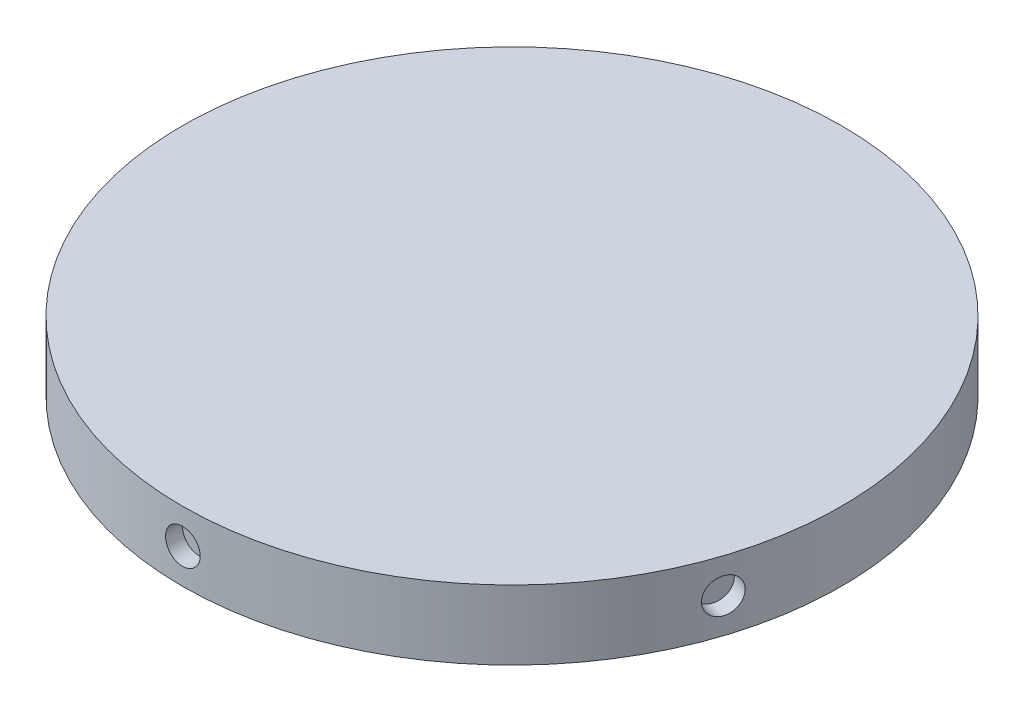
ISO-10303-21;
HEADER;
FILE_DESCRIPTION(('STEP AP214'),'2;1');
FILE_NAME('part.step','',(''),(''),'','','');
FILE_SCHEMA(('AUTOMOTIVE_DESIGN { 1 0 10303 214 1 1 1 1 }'));
ENDSEC;
DATA;
#1=APPLICATION_CONTEXT('core data for automotive mechanical design processes');
#2=APPLICATION_PROTOCOL_DEFINITION('international standard','automotive_design',2000,#1);
#3=PRODUCT_CONTEXT('',#1,'mechanical');
#4=PRODUCT('Part','Part','',(#3));
#5=PRODUCT_RELATED_PRODUCT_CATEGORY('part','',(#4));
#6=PRODUCT_DEFINITION_FORMATION('','',#4);
#7=PRODUCT_DEFINITION_CONTEXT('part definition',#1,'design');
#8=PRODUCT_DEFINITION('design','',#6,#7);
#9=PRODUCT_DEFINITION_SHAPE('','',#8);
#10=(LENGTH_UNIT() NAMED_UNIT(*) SI_UNIT(.MILLI.,.METRE.));
#11=(NAMED_UNIT(*) PLANE_ANGLE_UNIT() SI_UNIT($,.RADIAN.));
#12=(NAMED_UNIT(*) SI_UNIT($,.STERADIAN.) SOLID_ANGLE_UNIT());
#13=UNCERTAINTY_MEASURE_WITH_UNIT(LENGTH_MEASURE(1.E-05),#10,'distance_accuracy_value','');
#14=(GEOMETRIC_REPRESENTATION_CONTEXT(3) GLOBAL_UNCERTAINTY_ASSIGNED_CONTEXT((#13)) GLOBAL_UNIT_ASSIGNED_CONTEXT((#10,
#11,#12)) REPRESENTATION_CONTEXT('',''));
#15=CARTESIAN_POINT('',(0.,0.,0.));
#16=DIRECTION('',(0.,0.,1.));
#17=DIRECTION('',(1.,0.,0.));
#18=AXIS2_PLACEMENT_3D('',#15,#16,#17);
#19=CARTESIAN_POINT('',(0.,12.7,0.));
#20=DIRECTION('',(0.,-1.,0.));
#21=DIRECTION('',(0.,0.,-1.));
#22=AXIS2_PLACEMENT_3D('',#19,#20,#21);
#23=CYLINDRICAL_SURFACE('',#22,60.325);
#24=CARTESIAN_POINT('',(58.2740949216092,6.35,15.5960086582203));
#25=CARTESIAN_POINT('',(58.2740935598911,6.17179141950539,15.5960164809418));
#26=CARTESIAN_POINT('',(58.2702030382742,5.99345676522359,15.6105731562402));
#27=CARTESIAN_POINT('',(58.2546757506922,5.64170798205644,15.6684153734285));
#28=CARTESIAN_POINT('',(58.24302987893,5.46829988744188,15.7117346862469));
#29=CARTESIAN_POINT('',(58.2121399914263,5.13155050283682,15.8257970891836));
#30=CARTESIAN_POINT('',(58.1928998753155,4.96820409587701,15.8965261041311));
#31=CARTESIAN_POINT('',(58.14708864284,4.65616319450134,16.0632857166009));
#32=CARTESIAN_POINT('',(58.1205192469114,4.50746527268123,16.1593103761207));
#33=CARTESIAN_POINT('',(58.0604181120316,4.22873381288969,16.373938682914));
#34=CARTESIAN_POINT('',(58.0268796425148,4.09871852501773,16.4925641482345));
#35=CARTESIAN_POINT('',(57.9534219336702,3.86119872222298,16.7488579983049));
#36=CARTESIAN_POINT('',(57.913502432921,3.75369512998755,16.8865271632154));
#37=CARTESIAN_POINT('',(57.8280214802842,3.56419888880969,17.1769744509301));
#38=CARTESIAN_POINT('',(57.7824568650492,3.48222063468934,17.3297610353238));
#39=CARTESIAN_POINT('',(57.6866844028689,3.34619446923017,17.6459436016992));
#40=CARTESIAN_POINT('',(57.6364765938608,3.29214632971243,17.8093394969944));
#41=CARTESIAN_POINT('',(57.5326733506348,3.2135633237823,18.1418691213455));
#42=CARTESIAN_POINT('',(57.4790811299775,3.18900089080169,18.3109973387969));
#43=CARTESIAN_POINT('',(57.369887151209,3.17000145053513,18.650293016753));
#44=CARTESIAN_POINT('',(57.3142854102299,3.17556418647784,18.8204604683875));
#45=CARTESIAN_POINT('',(57.2027331990982,3.21663433069223,19.1568347070523));
#46=CARTESIAN_POINT('',(57.1467831289393,3.2521120715319,19.3230452503863));
#47=CARTESIAN_POINT('',(57.0362139592471,3.35195914400422,19.6470160269992));
#48=CARTESIAN_POINT('',(56.981594865738,3.41632860637849,19.8047762220349));
#49=CARTESIAN_POINT('',(56.8754620752649,3.57216569110866,20.1075412347327));
#50=CARTESIAN_POINT('',(56.8239499411786,3.6636468167213,20.2525396494674));
#51=CARTESIAN_POINT('',(56.725850613371,3.87110056087535,20.525705703149));
#52=CARTESIAN_POINT('',(56.6792634584003,3.98707337210033,20.6538732096691));
#53=CARTESIAN_POINT('',(56.5926531749035,4.24038613108785,20.8900240838425));
#54=CARTESIAN_POINT('',(56.5526380750506,4.37775182011244,20.997982785809));
#55=CARTESIAN_POINT('',(56.4807516772796,4.66986064481821,21.1905855844194));
#56=CARTESIAN_POINT('',(56.4488803817064,4.82460378550307,21.2752296743501));
#57=CARTESIAN_POINT('',(56.3945208463469,5.14709074014603,21.4189069170698));
#58=CARTESIAN_POINT('',(56.3720329500819,5.31483502980283,21.4779391322247));
#59=CARTESIAN_POINT('',(56.3373377006269,5.65855547387976,21.568782782084));
#60=CARTESIAN_POINT('',(56.3251302617611,5.83453155968436,21.6005944436407));
#61=CARTESIAN_POINT('',(56.3114972086904,6.18949426167802,21.6361104731803));
#62=CARTESIAN_POINT('',(56.3100586788124,6.36847701340148,21.6398485112342));
#63=CARTESIAN_POINT('',(56.3179876587267,6.72457105995048,21.6192046249637));
#64=CARTESIAN_POINT('',(56.3273551288546,6.90168236164295,21.5948228038558));
#65=CARTESIAN_POINT('',(56.3565091034409,7.24890467748867,21.5186233782586));
#66=CARTESIAN_POINT('',(56.3762897418088,7.41901957484243,21.4668212204836));
#67=CARTESIAN_POINT('',(56.4254778191091,7.74753981216546,21.3371941889757));
#68=CARTESIAN_POINT('',(56.4548853198443,7.90594507695288,21.2593691481803));
#69=CARTESIAN_POINT('',(56.5222109664278,8.20671513945481,21.0797169858428));
#70=CARTESIAN_POINT('',(56.5601371942799,8.34906451047537,20.9778670664528));
#71=CARTESIAN_POINT('',(56.6430420374702,8.61352678773028,20.7529693959175));
#72=CARTESIAN_POINT('',(56.6880207024882,8.7356395513992,20.6299214954464));
#73=CARTESIAN_POINT('',(56.7834254998003,8.95628342092408,20.3658514172115));
#74=CARTESIAN_POINT('',(56.8338569371126,9.0547912563733,20.2248117107432));
#75=CARTESIAN_POINT('',(56.9383509263756,9.22526988181571,19.9287338098999));
#76=CARTESIAN_POINT('',(56.9924134612471,9.29724079661842,19.7736956813672));
#77=CARTESIAN_POINT('',(57.1023254200859,9.41256194066804,19.4540121236109));
#78=CARTESIAN_POINT('',(57.1581739007086,9.45592702614538,19.2893717296884));
#79=CARTESIAN_POINT('',(57.2699173825609,9.51285418106591,18.9550321128248));
#80=CARTESIAN_POINT('',(57.3258123834882,9.52641644266634,18.7853329225081));
#81=CARTESIAN_POINT('',(57.4359332791788,9.52335114348945,18.4458936554643));
#82=CARTESIAN_POINT('',(57.4901611104538,9.50676006755393,18.2761538762923));
#83=CARTESIAN_POINT('',(57.5955490366075,9.44393451840173,17.941270382592));
#84=CARTESIAN_POINT('',(57.6467091257723,9.39769998997449,17.7761266766244));
#85=CARTESIAN_POINT('',(57.744701576661,9.27690760496991,17.4551780977181));
#86=CARTESIAN_POINT('',(57.7915339166524,9.20234960617182,17.2993732716773));
#87=CARTESIAN_POINT('',(57.8798336306308,9.02703271053505,17.0016067399213));
#88=CARTESIAN_POINT('',(57.9213011643306,8.9262745939548,16.8596446221333));
#89=CARTESIAN_POINT('',(57.9980994385415,8.70128586798166,16.5935325659201));
#90=CARTESIAN_POINT('',(58.033423383112,8.5770295783384,16.469402378967));
#91=CARTESIAN_POINT('',(58.0972693953285,8.30859324730592,16.2427466611513));
#92=CARTESIAN_POINT('',(58.1257897890591,8.16440831651488,16.1402264478322));
#93=CARTESIAN_POINT('',(58.1755987926046,7.86008435553708,15.9597659827837));
#94=CARTESIAN_POINT('',(58.1968800451471,7.69992930706033,15.8818507432689));
#95=CARTESIAN_POINT('',(58.2318545714961,7.3684458854963,15.753133937127));
#96=CARTESIAN_POINT('',(58.2455567942764,7.1971309579249,15.702300396286));
#97=CARTESIAN_POINT('',(58.2616176417241,6.91229560230922,15.6425723177308));
#98=CARTESIAN_POINT('',(58.266293459383,6.80061941629706,15.6251342117068));
#99=CARTESIAN_POINT('',(58.2725325296186,6.57597905390293,15.6018499070206));
#100=CARTESIAN_POINT('',(58.2740957851726,6.46301487875312,15.5960036972699));
#101=CARTESIAN_POINT('',(58.2740949216092,6.35,15.5960086582203));
#102=B_SPLINE_CURVE_WITH_KNOTS('',3,(#24,#25,#26,#27,#28,#29,#30,#31,#32,#33,#34,#35,#36,#37,
#38,#39,#40,#41,#42,#43,#44,#45,#46,#47,#48,#49,#50,#51,#52,#53,#54,#55,#56,#57,#58,#59,#60,#61,
#62,#63,#64,#65,#66,#67,#68,#69,#70,#71,#72,#73,#74,#75,#76,#77,#78,#79,#80,#81,#82,#83,#84,#85,
#86,#87,#88,#89,#90,#91,#92,#93,#94,#95,#96,#97,#98,#99,#100,#101),.UNSPECIFIED.,.T.,.F.,(4,2,2,
2,2,2,2,2,2,2,2,2,2,2,2,2,2,2,2,2,2,2,2,2,2,2,2,2,2,2,2,2,2,2,2,2,2,2,4),(0.,0.53421318853449,
1.06905472186082,1.60362197157737,2.13806384645123,2.67302429172578,3.20800665914605,
3.74329018168468,4.27856933108164,4.81334765036072,5.34812141147339,5.88236544746068,
6.41661190104814,6.9511248903171,7.48564208491947,8.02080748573454,8.55597304064593,
9.09115818596848,9.62633887108908,10.1608775851562,10.6954143371549,11.2296502882136,
11.7638896690429,12.2986380578617,12.8333902137841,13.3686673944642,13.9039420575748,
14.4389385103416,14.9739315136453,15.508277618687,16.0426247189449,16.5769745023575,
17.1113083742699,17.6462296095601,18.1812823190884,18.7168771991269,19.2518383156805,
19.5906216465116,19.9294046532724),.UNSPECIFIED.);
#103=CARTESIAN_POINT('',(58.2740949216092,6.35,15.5960086582203));
#104=VERTEX_POINT('',#103);
#105=EDGE_CURVE('E97',#104,#104,#102,.T.);
#106=ORIENTED_EDGE('',*,*,#105,.T.);
#107=EDGE_LOOP('',(#106));
#108=FACE_BOUND('',#107,.T.);
#109=CARTESIAN_POINT('',(32.8403713251921,6.35,-50.6025259865898));
#110=CARTESIAN_POINT('',(32.8403783442484,6.17179141950539,-50.6025222741651));
#111=CARTESIAN_POINT('',(32.8530203278499,5.99345676522359,-50.5943239081807));
#112=CARTESIAN_POINT('',(32.9032333496844,5.64170798205644,-50.561682352042));
#113=CARTESIAN_POINT('',(32.9408336921329,5.46829988744188,-50.5372200659691));
#114=CARTESIAN_POINT('',(33.0397679835172,5.13155050283682,-50.4725948162443));
#115=CARTESIAN_POINT('',(33.1010897512221,4.96820409587701,-50.4324399108287));
#116=CARTESIAN_POINT('',(33.2455311179482,4.65616319450134,-50.3373392854349));
#117=CARTESIAN_POINT('',(33.3286456012373,4.50746527268124,-50.2823970366322));
#118=CARTESIAN_POINT('',(33.5141969789354,4.22873381288969,-50.158913666395));
#119=CARTESIAN_POINT('',(33.616652543681,4.09871852501774,-50.0903594016649));
#120=CARTESIAN_POINT('',(33.837702799476,3.86119872222298,-49.9412978137706));
#121=CARTESIAN_POINT('',(33.9562981517186,3.75369512998755,-49.860790000897));
#122=CARTESIAN_POINT('',(34.2061148702797,3.56419888880969,-49.6897396359987));
#123=CARTESIAN_POINT('',(34.3373433065201,3.48222063468934,-49.5991914606768));
#124=CARTESIAN_POINT('',(34.6084554782035,3.34619446923017,-49.4104006501036));
#125=CARTESIAN_POINT('',(34.748339142926,3.29214632971243,-49.3121580777202));
#126=CARTESIAN_POINT('',(35.0325166427982,3.2135633237823,-49.1106780217798));
#127=CARTESIAN_POINT('',(35.1768062291454,3.18900089080169,-49.0074452976802));
#128=CARTESIAN_POINT('',(35.4657527994934,3.17000145053513,-48.7987475220258));
#129=CARTESIAN_POINT('',(35.6104097803524,3.17556418647784,-48.6932824895058));
#130=CARTESIAN_POINT('',(35.8958491629486,3.21663433069223,-48.4832446759844));
#131=CARTESIAN_POINT('',(36.0366352607478,3.25211207153189,-48.3786711146382));
#132=CARTESIAN_POINT('',(36.3105820264459,3.35195914400422,-48.1734011096469));
#133=CARTESIAN_POINT('',(36.4437426598349,3.4163286063785,-48.072704683549));
#134=CARTESIAN_POINT('',(36.6988924621507,3.57216569110867,-47.8782068673511));
#135=CARTESIAN_POINT('',(36.8208760244875,3.66364681672131,-47.7844089422497));
#136=CARTESIAN_POINT('',(37.0503580204427,3.87110056087535,-47.6066979844201));
#137=CARTESIAN_POINT('',(37.1578563400904,3.98707337210033,-47.5227850294681));
#138=CARTESIAN_POINT('',(37.3556851183136,4.24038613108785,-47.3674391216144));
#139=CARTESIAN_POINT('',(37.4459945994235,4.37775182011244,-47.2960214265507));
#140=CARTESIAN_POINT('',(37.606956627523,4.66986064481821,-47.1681358615828));
#141=CARTESIAN_POINT('',(37.6776091688525,4.82460378550307,-47.1116679959832));
#142=CARTESIAN_POINT('',(37.797456326552,5.14709074014602,-47.0155702959514));
#143=CARTESIAN_POINT('',(37.8466501573328,5.31483502980283,-46.9759410779723));
#144=CARTESIAN_POINT('',(37.9223261807898,5.65855547387976,-46.9148717032561));
#145=CARTESIAN_POINT('',(37.9488085627402,5.83453155968436,-46.8934313949352));
#146=CARTESIAN_POINT('',(37.9783734689827,6.18949426167801,-46.8694905342748));
#147=CARTESIAN_POINT('',(37.9814840242528,6.36847701340148,-46.8669672937762));
#148=CARTESIAN_POINT('',(37.9643007112351,6.72457105995048,-46.8808875134789));
#149=CARTESIAN_POINT('',(37.9440069288552,6.90168236164295,-46.8973309040613));
#150=CARTESIAN_POINT('',(37.8805460422037,7.24890467748867,-46.9486048990387));
#151=CARTESIAN_POINT('',(37.837391815909,7.41901957484243,-46.9834251511527));
#152=CARTESIAN_POINT('',(37.7293091347118,7.74753981216545,-47.0702627482595));
#153=CARTESIAN_POINT('',(37.6643805400217,7.90594507695288,-47.1222802036554));
#154=CARTESIAN_POINT('',(37.5143259493157,8.20671513945481,-47.2418262697909));
#155=CARTESIAN_POINT('',(37.4291807687345,8.34906451047537,-47.3093696118953));
#156=CARTESIAN_POINT('',(37.2409093791341,8.61352678773028,-47.4577140054347));
#157=CARTESIAN_POINT('',(37.1377830434495,8.7356395513992,-47.538515150262));
#158=CARTESIAN_POINT('',(36.9161191785,8.95628342092408,-47.710852646312));
#159=CARTESIAN_POINT('',(36.7975666177871,9.0547912563733,-47.8023994595744));
#160=CARTESIAN_POINT('',(36.5482702193514,9.22526988181571,-47.9932722519961));
#161=CARTESIAN_POINT('',(36.4175264389704,9.29724079661842,-48.0925981945657));
#162=CARTESIAN_POINT('',(36.1474539713802,9.41256194066804,-48.295918331407));
#163=CARTESIAN_POINT('',(36.0081297815172,9.45592702614538,-48.3999100725111));
#164=CARTESIAN_POINT('',(35.7246845451464,9.51285418106592,-48.6095010625839));
#165=CARTESIAN_POINT('',(35.5805635295729,9.52641644266634,-48.7151003011836));
#166=CARTESIAN_POINT('',(35.2917668309686,9.52335114348945,-48.9247239986851));
#167=CARTESIAN_POINT('',(35.1470920293446,9.50676006755392,-49.0287502073694));
#168=CARTESIAN_POINT('',(34.8611655606447,9.44393451840173,-49.2324647719657));
#169=CARTESIAN_POINT('',(34.7199138999447,9.39769998997449,-49.3321531197983));
#170=CARTESIAN_POINT('',(34.4449549952253,9.27690760496991,-49.5245280439662));
#171=CARTESIAN_POINT('',(34.3112477890927,9.20234960617181,-49.6172145851406));
#172=CARTESIAN_POINT('',(34.0553411009493,9.02703271053505,-49.7932075221755));
#173=CARTESIAN_POINT('',(33.933141276388,8.9262745939548,-49.8765141972693));
#174=CARTESIAN_POINT('',(33.7037856431316,8.70128586798166,-50.0317868441758));
#175=CARTESIAN_POINT('',(33.5966465191415,8.5770295783384,-50.1037402491242));
#176=CARTESIAN_POINT('',(33.4008136245553,8.30859324730592,-50.2345018837595));
#177=CARTESIAN_POINT('',(33.3121243939752,8.16440831651488,-50.2933068782468));
#178=CARTESIAN_POINT('',(33.1558881213257,7.86008435553708,-50.3964434061517));
#179=CARTESIAN_POINT('',(33.0883625937636,7.69992930706033,-50.440760213188));
#180=CARTESIAN_POINT('',(32.9767533595377,7.3684458854963,-50.5137986449362));
#181=CARTESIAN_POINT('',(32.9326420089744,7.1971309579249,-50.5425386612032));
#182=CARTESIAN_POINT('',(32.8808003054641,6.91229560230922,-50.5762704261404));
#183=CARTESIAN_POINT('',(32.8656605882173,6.80061941629705,-50.5861060641051));
#184=CARTESIAN_POINT('',(32.84544387725,6.57597905390293,-50.5992350183585));
#185=CARTESIAN_POINT('',(32.8403668739037,6.46301487875312,-50.6025283409054));
#186=CARTESIAN_POINT('',(32.8403713251921,6.35,-50.6025259865898));
#187=B_SPLINE_CURVE_WITH_KNOTS('',3,(#109,#110,#111,#112,#113,#114,#115,#116,#117,#118,#119,
#120,#121,#122,#123,#124,#125,#126,#127,#128,#129,#130,#131,#132,#133,#134,#135,#136,#137,#138,
#139,#140,#141,#142,#143,#144,#145,#146,#147,#148,#149,#150,#151,#152,#153,#154,#155,#156,#157,
#158,#159,#160,#161,#162,#163,#164,#165,#166,#167,#168,#169,#170,#171,#172,#173,#174,#175,#176,
#177,#178,#179,#180,#181,#182,#183,#184,#185,#186),.UNSPECIFIED.,.T.,.F.,(4,2,2,2,2,2,2,2,2,2,2,
2,2,2,2,2,2,2,2,2,2,2,2,2,2,2,2,2,2,2,2,2,2,2,2,2,2,2,4),(0.,0.53421318853449,1.06905472186082,
1.60362197157736,2.13806384645123,2.67302429172578,3.20800665914606,3.74329018168468,
4.27856933108164,4.81334765036072,5.3481214114734,5.88236544746069,6.41661190104814,
6.9511248903171,7.48564208491948,8.02080748573455,8.55597304064594,9.09115818596849,
9.62633887108908,10.1608775851562,10.6954143371549,11.2296502882136,11.7638896690429,
12.2986380578617,12.8333902137841,13.3686673944642,13.9039420575748,14.4389385103416,
14.9739315136453,15.508277618687,16.0426247189449,16.5769745023575,17.1113083742699,
17.6462296095601,18.1812823190884,18.7168771991269,19.2518383156805,19.5906216465116,
19.9294046532724),.UNSPECIFIED.);
#188=CARTESIAN_POINT('',(32.8403713251921,6.35,-50.6025259865898));
#189=VERTEX_POINT('',#188);
#190=EDGE_CURVE('E98',#189,#189,#187,.T.);
#191=ORIENTED_EDGE('',*,*,#190,.T.);
#192=EDGE_LOOP('',(#191));
#193=FACE_BOUND('',#192,.T.);
#194=CARTESIAN_POINT('',(-37.9776292394737,6.35,-46.8700896345321));
#195=CARTESIAN_POINT('',(-37.9776235397403,6.17179141950539,-46.8700951628489));
#196=CARTESIAN_POINT('',(-37.9659198425724,5.99345676522359,-46.8795849693168));
#197=CARTESIAN_POINT('',(-37.9193592008189,5.64170798205644,-46.9172535953656));
#198=CARTESIAN_POINT('',(-37.8844750394349,5.46829988744188,-46.9454543839484));
#199=CARTESIAN_POINT('',(-37.7924403972028,5.13155050283682,-47.0195761860238));
#200=CARTESIAN_POINT('',(-37.7353013444001,4.96820409587701,-47.0654881046094));
#201=CARTESIAN_POINT('',(-37.6002204379064,4.65616319450134,-47.1734722982345));
#202=CARTESIAN_POINT('',(-37.5222834663477,4.50746527268123,-47.2355407805759));
#203=CARTESIAN_POINT('',(-37.3475052733911,4.22873381288969,-47.3738521675172));
#204=CARTESIAN_POINT('',(-37.2506457825251,4.09871852501773,-47.4501087671607));
#205=CARTESIAN_POINT('',(-37.0405715023773,3.86119872222298,-47.6142774894954));
#206=CARTESIAN_POINT('',(-36.9273560430344,3.75369512998755,-47.7021900896902));
#207=CARTESIAN_POINT('',(-36.6874798673688,3.56419888880969,-47.8869224381096));
#208=CARTESIAN_POINT('',(-36.5608116182468,3.48222063468934,-47.9837471725351));
#209=CARTESIAN_POINT('',(-36.2974826192024,3.34619446923017,-48.1832506012126));
#210=CARTESIAN_POINT('',(-36.1608219509248,3.29214632971243,-48.2859292476326));
#211=CARTESIAN_POINT('',(-35.8813873539398,3.2135633237823,-48.4939373493573));
#212=CARTESIAN_POINT('',(-35.7386192646973,3.18900089080169,-48.5992642345639));
#213=CARTESIAN_POINT('',(-35.450846484521,3.17000145053513,-48.8095775937891));
#214=CARTESIAN_POINT('',(-35.3058418126612,3.17556418647784,-48.9145640707016));
#215=CARTESIAN_POINT('',(-35.0178783613572,3.21663433069223,-49.1211278016876));
#216=CARTESIAN_POINT('',(-34.874917697615,3.25211207153189,-49.2227083297849));
#217=CARTESIAN_POINT('',(-34.5950401156133,3.35195914400422,-49.4198152664424));
#218=CARTESIAN_POINT('',(-34.4581232247063,3.4163286063785,-49.5153416476039));
#219=CARTESIAN_POINT('',(-34.1942991841791,3.57216569110866,-49.6979003991538));
#220=CARTESIAN_POINT('',(-34.0673970625,3.6636468167213,-49.7849285081017));
#221=CARTESIAN_POINT('',(-33.8274700613859,3.87110056087535,-49.9482631496713));
#222=CARTESIAN_POINT('',(-33.7144452911394,3.98707337210033,-50.0245695979346));
#223=CARTESIAN_POINT('',(-33.5055700987478,4.24038613108785,-50.1647114210411));
#224=CARTESIAN_POINT('',(-33.4097406700626,4.37775182011243,-50.2285315600602));
#225=CARTESIAN_POINT('',(-33.238374268028,4.66986064481821,-50.3420967328499));
#226=CARTESIAN_POINT('',(-33.1628373005216,4.82460378550307,-50.3918417625678));
#227=CARTESIAN_POINT('',(-33.0344081482488,5.14709074014603,-50.4761273604272));
#228=CARTESIAN_POINT('',(-32.9815167925244,5.31483502980282,-50.5106673719235));
#229=CARTESIAN_POINT('',(-32.9000511884396,5.65855547387976,-50.5637680725365));
#230=CARTESIAN_POINT('',(-32.8714767374254,5.83453155968436,-50.5823288948215));
#231=CARTESIAN_POINT('',(-32.8395715674226,6.18949426167802,-50.6030486587531));
#232=CARTESIAN_POINT('',(-32.8362106086638,6.36847701340148,-50.6052272484171));
#233=CARTESIAN_POINT('',(-32.8547594600623,6.72457105995048,-50.5931865310537));
#234=CARTESIAN_POINT('',(-32.8766691774613,6.90168236164295,-50.5789672842161));
#235=CARTESIAN_POINT('',(-32.9450441369544,7.24890467748867,-50.5344569302538));
#236=CARTESIAN_POINT('',(-32.9914955539307,7.41901957484243,-50.5041748717822));
#237=CARTESIAN_POINT('',(-33.1074824018061,7.74753981216546,-50.4282164267877));
#238=CARTESIAN_POINT('',(-33.1770179809015,7.90594507695288,-50.3825399414352));
#239=CARTESIAN_POINT('',(-33.3370824647093,8.20671513945481,-50.2767713111908));
#240=CARTESIAN_POINT('',(-33.4276313081388,8.34906451047538,-50.216665472935));
#241=CARTESIAN_POINT('',(-33.6268942692114,8.61352678773029,-50.0834496796476));
#242=CARTESIAN_POINT('',(-33.7356085148176,8.7356395513992,-50.0103396330096));
#243=CARTESIAN_POINT('',(-33.9680091147462,8.95628342092408,-49.8527799848697));
#244=CARTESIAN_POINT('',(-34.0917100640324,9.05479125637331,-49.7683193205592));
#245=CARTESIAN_POINT('',(-34.3502777008016,9.22526988181571,-49.5902072929602));
#246=CARTESIAN_POINT('',(-34.4851443357661,9.29724079661842,-49.4965559729001));
#247=CARTESIAN_POINT('',(-34.7619702590013,9.41256194066804,-49.3025311703091));
#248=CARTESIAN_POINT('',(-34.9039258244144,9.45592702614538,-49.2021612069381));
#249=CARTESIAN_POINT('',(-35.190848096293,9.51285418106592,-48.9973559456752));
#250=CARTESIAN_POINT('',(-35.3358147833379,9.52641644266634,-48.8929206739993));
#251=CARTESIAN_POINT('',(-35.6244218546047,9.52335114348945,-48.6830359768589));
#252=CARTESIAN_POINT('',(-35.768063630599,9.50676006755393,-48.5775879303745));
#253=CARTESIAN_POINT('',(-36.0501638326925,9.44393451840173,-48.3686069615981));
#254=CARTESIAN_POINT('',(-36.1886222491373,9.39769998997449,-48.2650740428733));
#255=CARTESIAN_POINT('',(-36.456548648652,9.2769076049699,-48.063019705686));
#256=CARTESIAN_POINT('',(-36.5860165865741,9.20234960617181,-47.9644983123907));
#257=CARTESIAN_POINT('',(-36.8324753317736,9.02703271053504,-47.7755013975021));
#258=CARTESIAN_POINT('',(-36.9494665104715,8.9262745939548,-47.6850256364119));
#259=CARTESIAN_POINT('',(-37.1680143615462,8.70128586798166,-47.5148773535101));
#260=CARTESIAN_POINT('',(-37.2695539262674,8.5770295783384,-47.4352168164213));
#261=CARTESIAN_POINT('',(-37.4544313234535,8.30859324730592,-47.2893762332348));
#262=CARTESIAN_POINT('',(-37.5377646761186,8.16440831651488,-47.223199505217));
#263=CARTESIAN_POINT('',(-37.6841330064371,7.86008435553708,-47.1064809198954));
#264=CARTESIAN_POINT('',(-37.7471473301212,7.69992930706033,-47.055954973402));
#265=CARTESIAN_POINT('',(-37.8511001566802,7.3684458854963,-46.9723784005654));
#266=CARTESIAN_POINT('',(-37.8920646933983,7.1971309579249,-46.9393071666147));
#267=CARTESIAN_POINT('',(-37.9401654756501,6.91229560230922,-46.9004264652912));
#268=CARTESIAN_POINT('',(-37.9541981531476,6.80061941629706,-46.8890671178304));
#269=CARTESIAN_POINT('',(-37.9729318379016,6.57597905390293,-46.8738969531095));
#270=CARTESIAN_POINT('',(-37.9776328540846,6.46301487875312,-46.8700861286287));
#271=CARTESIAN_POINT('',(-37.9776292394737,6.35,-46.8700896345321));
#272=B_SPLINE_CURVE_WITH_KNOTS('',3,(#194,#195,#196,#197,#198,#199,#200,#201,#202,#203,#204,
#205,#206,#207,#208,#209,#210,#211,#212,#213,#214,#215,#216,#217,#218,#219,#220,#221,#222,#223,
#224,#225,#226,#227,#228,#229,#230,#231,#232,#233,#234,#235,#236,#237,#238,#239,#240,#241,#242,
#243,#244,#245,#246,#247,#248,#249,#250,#251,#252,#253,#254,#255,#256,#257,#258,#259,#260,#261,
#262,#263,#264,#265,#266,#267,#268,#269,#270,#271),.UNSPECIFIED.,.T.,.F.,(4,2,2,2,2,2,2,2,2,2,2,
2,2,2,2,2,2,2,2,2,2,2,2,2,2,2,2,2,2,2,2,2,2,2,2,2,2,2,4),(0.,0.53421318853449,1.06905472186082,
1.60362197157736,2.13806384645123,2.67302429172578,3.20800665914605,3.74329018168468,
4.27856933108164,4.81334765036072,5.34812141147339,5.88236544746068,6.41661190104814,
6.95112489031709,7.48564208491947,8.02080748573454,8.55597304064593,9.09115818596848,
9.62633887108908,10.1608775851562,10.6954143371549,11.2296502882136,11.7638896690429,
12.2986380578617,12.8333902137841,13.3686673944642,13.9039420575748,14.4389385103416,
14.9739315136453,15.508277618687,16.0426247189449,16.5769745023575,17.1113083742699,
17.6462296095601,18.1812823190884,18.7168771991269,19.2518383156805,19.5906216465116,
19.9294046532724),.UNSPECIFIED.);
#273=CARTESIAN_POINT('',(-37.9776292394737,6.35,-46.8700896345321));
#274=VERTEX_POINT('',#273);
#275=EDGE_CURVE('E61',#274,#274,#272,.T.);
#276=ORIENTED_EDGE('',*,*,#275,.T.);
#277=EDGE_LOOP('',(#276));
#278=FACE_BOUND('',#277,.T.);
#279=CARTESIAN_POINT('',(-56.311837007328,6.35,21.6352175366953));
#280=CARTESIAN_POINT('',(-56.3118405037552,6.17179141950539,21.6352104075828));
#281=CARTESIAN_POINT('',(-56.317249204713,5.99345676522359,21.6211470186547));
#282=CARTESIAN_POINT('',(-56.3386861674058,5.64170798205644,21.5652249713083));
#283=CARTESIAN_POINT('',(-56.3547269124499,5.46829988744188,21.5233336393817));
#284=CARTESIAN_POINT('',(-56.3967806667923,5.13155050283681,21.4128985966669));
#285=CARTESIAN_POINT('',(-56.4227885577802,4.96820409587701,21.3443685650767));
#286=CARTESIAN_POINT('',(-56.4837453330621,4.65616319450134,21.1825300377748));
#287=CARTESIAN_POINT('',(-56.5186921189477,4.50746527268124,21.089227357255));
#288=CARTESIAN_POINT('',(-56.5962246329063,4.22873381288969,20.880262848857));
#289=CARTESIAN_POINT('',(-56.6388177401637,4.09871852501773,20.7645794136807));
#290=CARTESIAN_POINT('',(-56.7300349506652,3.86119872222298,20.5140559754939));
#291=CARTESIAN_POINT('',(-56.778659300982,3.75369512998755,20.3792151876606));
#292=CARTESIAN_POINT('',(-56.8802243898904,3.56419888880969,20.0939939526174));
#293=CARTESIAN_POINT('',(-56.9331675428779,3.48222063468934,19.9436048004689));
#294=CARTESIAN_POINT('',(-57.0415334429284,3.34619446923017,19.6315140901009));
#295=CARTESIAN_POINT('',(-57.0969561697301,3.29214632971243,19.4698126243111));
#296=CARTESIAN_POINT('',(-57.208433591033,3.2135633237823,19.1397764915695));
#297=CARTESIAN_POINT('',(-57.2644876457194,3.18900089080169,18.971448172483));
#298=CARTESIAN_POINT('',(-57.3755808568814,3.17000145053513,18.6327695925393));
#299=CARTESIAN_POINT('',(-57.4306200220035,3.17556418647784,18.4624193489283));
#300=CARTESIAN_POINT('',(-57.5380882041761,3.21663433069223,18.1247181288146));
#301=CARTESIAN_POINT('',(-57.5905197527283,3.25211207153189,17.957364348509));
#302=CARTESIAN_POINT('',(-57.6914926600603,3.35195914400422,17.630275557245));
#303=CARTESIAN_POINT('',(-57.7400340012348,3.41632860637849,17.4705405807671));
#304=CARTESIAN_POINT('',(-57.8321315794555,3.57216569110867,17.1632152511676));
#305=CARTESIAN_POINT('',(-57.8756853173501,3.6636468167213,17.0156309967598));
#306=CARTESIAN_POINT('',(-57.956884271798,3.87110056087535,16.7369736788999));
#307=CARTESIAN_POINT('',(-57.9945294418626,3.98707337210033,16.6059007453604));
#308=CARTESIAN_POINT('',(-58.0632662517812,4.24038613108785,16.3639424275814));
#309=CARTESIAN_POINT('',(-58.0943498888412,4.37775182011244,16.2530817174373));
#310=CARTESIAN_POINT('',(-58.1494016559535,4.66986064481821,16.055009015747));
#311=CARTESIAN_POINT('',(-58.173369783957,4.82460378550307,15.9677970310104));
#312=CARTESIAN_POINT('',(-58.2138433604055,5.14709074014603,15.8196079667394));
#313=CARTESIAN_POINT('',(-58.2303485356376,5.31483502980282,15.7586318476838));
#314=CARTESIAN_POINT('',(-58.2556760468562,5.65855547387976,15.6647444351624));
#315=CARTESIAN_POINT('',(-58.2644984468699,5.83453155968436,15.6318329078101));
#316=CARTESIAN_POINT('',(-58.2743448736338,6.18949426167802,15.5950865288011));
#317=CARTESIAN_POINT('',(-58.2753782421562,6.36847701340148,15.5912168458426));
#318=CARTESIAN_POINT('',(-58.2696587497551,6.72457105995048,15.6125786381248));
#319=CARTESIAN_POINT('',(-58.2629059174117,6.90168236164295,15.6378100065474));
#320=CARTESIAN_POINT('',(-58.2417030797063,7.24890467748867,15.7165929131246));
#321=CARTESIAN_POINT('',(-58.2272574079285,7.41901957484243,15.7701285066235));
#322=CARTESIAN_POINT('',(-58.1908585409663,7.74753981216546,15.9039110044695));
#323=CARTESIAN_POINT('',(-58.1689052975845,7.90594507695288,15.9841580802998));
#324=CARTESIAN_POINT('',(-58.1177759982635,8.20671513945481,16.1690727548699));
#325=CARTESIAN_POINT('',(-58.0885930805637,8.34906451047537,16.2737635479387));
#326=CARTESIAN_POINT('',(-58.0234729736051,8.61352678773028,16.504439829568));
#327=CARTESIAN_POINT('',(-57.9875357367664,8.7356395513992,16.6304254681366));
#328=CARTESIAN_POINT('',(-57.9095033415787,8.95628342092408,16.9001401819926));
#329=CARTESIAN_POINT('',(-57.8674021719653,9.0547912563733,17.0438865565112));
#330=CARTESIAN_POINT('',(-57.7779093614437,9.22526988181571,17.3448386357943));
#331=CARTESIAN_POINT('',(-57.7305177454191,9.29724079661842,17.5020442772523));
#332=CARTESIAN_POINT('',(-57.6315331073553,9.41256194066804,17.8252783367554));
#333=CARTESIAN_POINT('',(-57.5799422818098,9.45592702614538,17.9913021266723));
#334=CARTESIAN_POINT('',(-57.4738247615894,9.51285418106592,18.3274697292803));
#335=CARTESIAN_POINT('',(-57.419298085846,9.52641644266634,18.4976135154001));
#336=CARTESIAN_POINT('',(-57.3088703666782,9.52335114348945,18.8369530894529));
#337=CARTESIAN_POINT('',(-57.2529710648231,9.50676006755393,19.0061497749117));
#338=CARTESIAN_POINT('',(-57.1413921092501,9.44393451840173,19.3390216812138));
#339=CARTESIAN_POINT('',(-57.0857124559415,9.39769998997449,19.5026968917727));
#340=CARTESIAN_POINT('',(-56.9763411726056,9.27690760496991,19.8199482638968));
#341=CARTESIAN_POINT('',(-56.9226495525622,9.20234960617181,19.9735243747467));
#342=CARTESIAN_POINT('',(-56.8190627457767,9.02703271053505,20.2663238289515));
#343=CARTESIAN_POINT('',(-56.7691674460347,8.9262745939548,20.4055475995572));
#344=CARTESIAN_POINT('',(-56.6748818129107,8.70128586798166,20.6659776684244));
#345=CARTESIAN_POINT('',(-56.6304975911211,8.5770295783384,20.7871639928557));
#346=CARTESIAN_POINT('',(-56.5489252117476,8.30859324730592,21.0080600648394));
#347=CARTESIAN_POINT('',(-56.5117388255109,8.16440831651488,21.1077645265059));
#348=CARTESIAN_POINT('',(-56.4459631558748,7.86008435553708,21.2830371072584));
#349=CARTESIAN_POINT('',(-56.4173826221276,7.69992930706033,21.3585806665414));
#350=CARTESIAN_POINT('',(-56.3700197679418,7.3684458854963,21.4832722609658));
#351=CARTESIAN_POINT('',(-56.3512258934037,7.1971309579249,21.5324514238643));
#352=CARTESIAN_POINT('',(-56.3291121082104,6.91229560230922,21.5902127837259));
#353=CARTESIAN_POINT('',(-56.3226450626103,6.80061941629705,21.6070688845113));
#354=CARTESIAN_POINT('',(-56.3140064055555,6.57597905390293,21.6295735161771));
#355=CARTESIAN_POINT('',(-56.3118347899919,6.46301487875312,21.6352220577783));
#356=CARTESIAN_POINT('',(-56.311837007328,6.35,21.6352175366953));
#357=B_SPLINE_CURVE_WITH_KNOTS('',3,(#279,#280,#281,#282,#283,#284,#285,#286,#287,#288,#289,
#290,#291,#292,#293,#294,#295,#296,#297,#298,#299,#300,#301,#302,#303,#304,#305,#306,#307,#308,
#309,#310,#311,#312,#313,#314,#315,#316,#317,#318,#319,#320,#321,#322,#323,#324,#325,#326,#327,
#328,#329,#330,#331,#332,#333,#334,#335,#336,#337,#338,#339,#340,#341,#342,#343,#344,#345,#346,
#347,#348,#349,#350,#351,#352,#353,#354,#355,#356),.UNSPECIFIED.,.T.,.F.,(4,2,2,2,2,2,2,2,2,2,2,
2,2,2,2,2,2,2,2,2,2,2,2,2,2,2,2,2,2,2,2,2,2,2,2,2,2,2,4),(0.,0.534213188534491,1.06905472186082,
1.60362197157737,2.13806384645123,2.67302429172578,3.20800665914605,3.74329018168468,
4.27856933108164,4.81334765036072,5.34812141147339,5.88236544746068,6.41661190104814,
6.9511248903171,7.48564208491947,8.02080748573454,8.55597304064593,9.09115818596849,
9.62633887108908,10.1608775851562,10.6954143371549,11.2296502882136,11.7638896690429,
12.2986380578617,12.8333902137841,13.3686673944642,13.9039420575748,14.4389385103416,
14.9739315136453,15.508277618687,16.0426247189449,16.5769745023575,17.1113083742699,
17.6462296095601,18.1812823190884,18.7168771991269,19.2518383156805,19.5906216465116,
19.9294046532724),.UNSPECIFIED.);
#358=CARTESIAN_POINT('',(-56.311837007328,6.35,21.6352175366953));
#359=VERTEX_POINT('',#358);
#360=EDGE_CURVE('E62',#359,#359,#357,.T.);
#361=ORIENTED_EDGE('',*,*,#360,.T.);
#362=EDGE_LOOP('',(#361));
#363=FACE_BOUND('',#362,.T.);
#364=CARTESIAN_POINT('',(3.175,6.35,60.2413894262076));
#365=CARTESIAN_POINT('',(3.17499213935569,6.17179141950539,60.2413905484906));
#366=CARTESIAN_POINT('',(3.15994568116096,5.99345676522359,60.2421887026039));
#367=CARTESIAN_POINT('',(3.10013626784772,5.64170798205644,60.2452956026722));
#368=CARTESIAN_POINT('',(3.05533838082152,5.46829988744188,60.2476061242903));
#369=CARTESIAN_POINT('',(2.93731308905126,5.13155050283682,60.253475316419));
#370=CARTESIAN_POINT('',(2.86410027564237,4.96820409587701,60.2570333462317));
#371=CARTESIAN_POINT('',(2.69134601017989,4.65616319450134,60.2649958292949));
#372=CARTESIAN_POINT('',(2.59181073714632,4.50746527268123,60.2694000838337));
#373=CARTESIAN_POINT('',(2.36911481533013,4.22873381288969,60.2785643021425));
#374=CARTESIAN_POINT('',(2.24593133649253,4.09871852501774,60.2833246069118));
#375=CARTESIAN_POINT('',(1.97948171989587,3.86119872222298,60.2926613294685));
#376=CARTESIAN_POINT('',(1.83621475937631,3.75369512998755,60.2972377397125));
#377=CARTESIAN_POINT('',(1.53356790669488,3.56419888880969,60.305693670562));
#378=CARTESIAN_POINT('',(1.374178989555,3.48222063468934,60.3095727974205));
#379=CARTESIAN_POINT('',(1.04387618105792,3.34619446923017,60.3161935595174));
#380=CARTESIAN_POINT('',(0.872962383867714,3.29214632971243,60.3189352040486));
#381=CARTESIAN_POINT('',(0.52463095153934,3.2135633237823,60.3229697582235));
#382=CARTESIAN_POINT('',(0.347219551293408,3.18900089080169,60.3242640209655));
#383=CARTESIAN_POINT('',(-0.00921260930041343,3.17000145053513,60.325262506524));
#384=CARTESIAN_POINT('',(-0.188233355918082,3.17556418647784,60.324966742893));
#385=CARTESIAN_POINT('',(-0.542615796513938,3.21663433069223,60.3228196418064));
#386=CARTESIAN_POINT('',(-0.717980939344226,3.25211207153189,60.3209698455291));
#387=CARTESIAN_POINT('',(-1.06026321001997,3.35195914400422,60.3159247918463));
#388=CARTESIAN_POINT('',(-1.22718029963226,3.4163286063785,60.3127295283522));
#389=CARTESIAN_POINT('',(-1.54792377378139,3.57216569110866,60.3053507806059));
#390=CARTESIAN_POINT('',(-1.70174358581648,3.6636468167213,60.3011668041254));
#391=CARTESIAN_POINT('',(-1.99185430063029,3.87110056087535,60.2922817520438));
#392=CARTESIAN_POINT('',(-2.12814506548908,3.98707337210033,60.2875806723745));
#393=CARTESIAN_POINT('',(-2.37950194268855,4.24038613108785,60.2781840312329));
#394=CARTESIAN_POINT('',(-2.49454211557076,4.37775182011244,60.2734884833659));
#395=CARTESIAN_POINT('',(-2.69993238082155,4.66986064481821,60.2646379942676));
#396=CARTESIAN_POINT('',(-2.7902824660808,4.82460378550307,60.2604830531919));
#397=CARTESIAN_POINT('',(-2.9437256642451,5.14709074014603,60.2531827725707));
#398=CARTESIAN_POINT('',(-3.00681777925317,5.31483502980282,60.2500374699886));
#399=CARTESIAN_POINT('',(-3.10393664612154,5.65855547387976,60.2451125585476));
#400=CARTESIAN_POINT('',(-3.13796364020652,5.83453155968436,60.2433329383073));
#401=CARTESIAN_POINT('',(-3.1759542366172,6.18949426167802,60.2413421910478));
#402=CARTESIAN_POINT('',(-3.17995385224575,6.36847701340148,60.2411291851178));
#403=CARTESIAN_POINT('',(-3.15787016014491,6.72457105995048,60.2422907814453));
#404=CARTESIAN_POINT('',(-3.13178696283732,6.90168236164295,60.2436653778755));
#405=CARTESIAN_POINT('',(-3.05030792898439,7.24890467748867,60.2478455379105));
#406=CARTESIAN_POINT('',(-2.99492859585909,7.41901957484243,60.2506502958291));
#407=CARTESIAN_POINT('',(-2.85644601104911,7.74753981216546,60.2573739816033));
#408=CARTESIAN_POINT('',(-2.7733425813804,7.90594507695288,60.2612929166117));
#409=CARTESIAN_POINT('',(-2.58167845277124,8.20671513945481,60.2698078402703));
#410=CARTESIAN_POINT('',(-2.47309357431241,8.34906451047537,60.2744044704402));
#411=CARTESIAN_POINT('',(-2.23358417378838,8.61352678773028,60.2837544595981));
#412=CARTESIAN_POINT('',(-2.1026594943541,8.7356395513992,60.2885078196899));
#413=CARTESIAN_POINT('',(-1.82203222197588,8.95628342092408,60.297641031979));
#414=CARTESIAN_POINT('',(-1.67231131890253,9.05479125637331,60.3020205128806));
#415=CARTESIAN_POINT('',(-1.35843408348221,9.22526988181571,60.3099070992634));
#416=CARTESIAN_POINT('',(-1.19427781903273,9.29724079661842,60.3134142088476));
#417=CARTESIAN_POINT('',(-0.856276025110006,9.41256194066804,60.3191590413511));
#418=CARTESIAN_POINT('',(-0.682435576002092,9.45592702614538,60.3213974230899));
#419=CARTESIAN_POINT('',(-0.329929069825367,9.51285418106592,60.3243551661553));
#420=CARTESIAN_POINT('',(-0.151263043877552,9.52641644266634,60.325074537276));
#421=CARTESIAN_POINT('',(0.205592111135074,9.52335114348945,60.3249132306281));
#422=CARTESIAN_POINT('',(0.383781555623172,9.50676006755393,60.3240344865412));
#423=CARTESIAN_POINT('',(0.734841344689987,9.44393451840173,60.3207796697594));
#424=CARTESIAN_POINT('',(0.907711679361299,9.39769998997449,60.3184035942758));
#425=CARTESIAN_POINT('',(1.24323324937085,9.2769076049699,60.3124213880387));
#426=CARTESIAN_POINT('',(1.40588443339085,9.20234960617181,60.3088152511087));
#427=CARTESIAN_POINT('',(1.71636334596979,9.02703271053505,60.3007783508062));
#428=CARTESIAN_POINT('',(1.86419151578717,8.9262745939548,60.2963476119921));
#429=CARTESIAN_POINT('',(2.14101109278324,8.70128586798166,60.2871539633427));
#430=CARTESIAN_POINT('',(2.26998161513463,8.5770295783384,60.2823906937241));
#431=CARTESIAN_POINT('',(2.50527351531676,8.30859324730592,60.2730713910049));
#432=CARTESIAN_POINT('',(2.61158931859487,8.16440831651488,60.268515409127));
#433=CARTESIAN_POINT('',(2.79860924838132,7.86008435553708,60.2601212360064));
#434=CARTESIAN_POINT('',(2.87928731333777,7.69992930706033,60.256283776781));
#435=CARTESIAN_POINT('',(3.01251199358785,7.3684458854963,60.2497708474101));
#436=CARTESIAN_POINT('',(3.06509178355081,7.1971309579249,60.2470940076689));
#437=CARTESIAN_POINT('',(3.12685963667192,6.91229560230922,60.2439117899763));
#438=CARTESIAN_POINT('',(3.14488916815709,6.80061941629706,60.2429700857187));
#439=CARTESIAN_POINT('',(3.1689618365882,6.57597905390293,60.2417085482716));
#440=CARTESIAN_POINT('',(3.17500498499995,6.46301487875312,60.2413887144872));
#441=CARTESIAN_POINT('',(3.175,6.35,60.2413894262076));
#442=B_SPLINE_CURVE_WITH_KNOTS('',3,(#364,#365,#366,#367,#368,#369,#370,#371,#372,#373,#374,
#375,#376,#377,#378,#379,#380,#381,#382,#383,#384,#385,#386,#387,#388,#389,#390,#391,#392,#393,
#394,#395,#396,#397,#398,#399,#400,#401,#402,#403,#404,#405,#406,#407,#408,#409,#410,#411,#412,
#413,#414,#415,#416,#417,#418,#419,#420,#421,#422,#423,#424,#425,#426,#427,#428,#429,#430,#431,
#432,#433,#434,#435,#436,#437,#438,#439,#440,#441),.UNSPECIFIED.,.T.,.F.,(4,2,2,2,2,2,2,2,2,2,2,
2,2,2,2,2,2,2,2,2,2,2,2,2,2,2,2,2,2,2,2,2,2,2,2,2,2,2,4),(0.,0.534213188534491,1.06905472186082,
1.60362197157736,2.13806384645123,2.67302429172578,3.20800665914605,3.74329018168468,
4.27856933108164,4.81334765036072,5.34812141147339,5.88236544746069,6.41661190104814,
6.95112489031709,7.48564208491947,8.02080748573454,8.55597304064593,9.09115818596849,
9.62633887108908,10.1608775851562,10.6954143371549,11.2296502882136,11.7638896690429,
12.2986380578617,12.8333902137841,13.3686673944642,13.9039420575748,14.4389385103416,
14.9739315136453,15.508277618687,16.0426247189449,16.5769745023575,17.1113083742699,
17.6462296095601,18.1812823190884,18.7168771991269,19.2518383156805,19.5906216465116,
19.9294046532724),.UNSPECIFIED.);
#443=CARTESIAN_POINT('',(3.175,6.35,60.2413894262076));
#444=VERTEX_POINT('',#443);
#445=EDGE_CURVE('E40',#444,#444,#442,.T.);
#446=ORIENTED_EDGE('',*,*,#445,.T.);
#447=EDGE_LOOP('',(#446));
#448=FACE_BOUND('',#447,.T.);
#449=CARTESIAN_POINT('',(0.,12.7,0.));
#450=DIRECTION('',(0.,1.,0.));
#451=DIRECTION('',(0.,0.,1.));
#452=AXIS2_PLACEMENT_3D('',#449,#450,#451);
#453=CIRCLE('',#452,60.325);
#454=CARTESIAN_POINT('',(0.,12.7,60.325));
#455=VERTEX_POINT('',#454);
#456=EDGE_CURVE('E11',#455,#455,#453,.T.);
#457=ORIENTED_EDGE('',*,*,#456,.F.);
#458=EDGE_LOOP('',(#457));
#459=FACE_BOUND('',#458,.T.);
#460=CARTESIAN_POINT('',(0.,0.,0.));
#461=DIRECTION('',(0.,1.,0.));
#462=DIRECTION('',(0.,0.,1.));
#463=AXIS2_PLACEMENT_3D('',#460,#461,#462);
#464=CIRCLE('',#463,60.325);
#465=CARTESIAN_POINT('',(0.,0.,60.325));
#466=VERTEX_POINT('',#465);
#467=EDGE_CURVE('E48',#466,#466,#464,.T.);
#468=ORIENTED_EDGE('',*,*,#467,.T.);
#469=EDGE_LOOP('',(#468));
#470=FACE_BOUND('',#469,.T.);
#471=ADVANCED_FACE('F36',(#108,#193,#278,#363,#448,#459,#470),#23,.T.);
#472=CARTESIAN_POINT('',(0.,12.7,0.));
#473=DIRECTION('',(0.,1.,0.));
#474=DIRECTION('',(0.,0.,1.));
#475=AXIS2_PLACEMENT_3D('',#472,#473,#474);
#476=PLANE('',#475);
#477=ORIENTED_EDGE('',*,*,#456,.T.);
#478=EDGE_LOOP('',(#477));
#479=FACE_BOUND('',#478,.T.);
#480=ADVANCED_FACE('F140',(#479),#476,.T.);
#481=CARTESIAN_POINT('',(0.,0.,0.));
#482=DIRECTION('',(0.,1.,0.));
#483=DIRECTION('',(0.,0.,1.));
#484=AXIS2_PLACEMENT_3D('',#481,#482,#483);
#485=PLANE('',#484);
#486=ORIENTED_EDGE('',*,*,#467,.F.);
#487=EDGE_LOOP('',(#486));
#488=FACE_BOUND('',#487,.T.);
#489=ADVANCED_FACE('F144',(#488),#485,.F.);
#490=CARTESIAN_POINT('',(0.,6.35,57.15));
#491=DIRECTION('',(0.,0.,1.));
#492=DIRECTION('',(1.,0.,0.));
#493=AXIS2_PLACEMENT_3D('',#490,#491,#492);
#494=CYLINDRICAL_SURFACE('',#493,3.175);
#495=CARTESIAN_POINT('',(0.,6.35,57.15));
#496=DIRECTION('',(0.,0.,1.));
#497=DIRECTION('',(1.,0.,0.));
#498=AXIS2_PLACEMENT_3D('',#495,#496,#497);
#499=CIRCLE('',#498,3.175);
#500=CARTESIAN_POINT('',(3.175,6.35,57.15));
#501=VERTEX_POINT('',#500);
#502=EDGE_CURVE('E54',#501,#501,#499,.T.);
#503=ORIENTED_EDGE('',*,*,#502,.F.);
#504=EDGE_LOOP('',(#503));
#505=FACE_BOUND('',#504,.T.);
#506=ORIENTED_EDGE('',*,*,#445,.F.);
#507=EDGE_LOOP('',(#506));
#508=FACE_BOUND('',#507,.T.);
#509=ADVANCED_FACE('F160',(#505,#508),#494,.F.);
#510=CARTESIAN_POINT('',(0.,6.35,57.15));
#511=DIRECTION('',(0.,0.,1.));
#512=DIRECTION('',(1.,0.,0.));
#513=AXIS2_PLACEMENT_3D('',#510,#511,#512);
#514=PLANE('',#513);
#515=ORIENTED_EDGE('',*,*,#502,.T.);
#516=EDGE_LOOP('',(#515));
#517=FACE_BOUND('',#516,.T.);
#518=ADVANCED_FACE('F79',(#517),#514,.T.);
#519=CARTESIAN_POINT('',(-54.3528799062678,6.35,17.660321228529));
#520=DIRECTION('',(-0.951056516295149,0.,0.309016994374961));
#521=DIRECTION('',(0.309016994374961,0.,0.951056516295149));
#522=AXIS2_PLACEMENT_3D('',#519,#520,#521);
#523=CYLINDRICAL_SURFACE('',#522,3.175);
#524=CARTESIAN_POINT('',(-54.3528799062678,6.35,17.660321228529));
#525=DIRECTION('',(-0.951056516295149,0.,0.309016994374961));
#526=DIRECTION('',(0.309016994374961,0.,0.951056516295149));
#527=AXIS2_PLACEMENT_3D('',#524,#525,#526);
#528=CIRCLE('',#527,3.175);
#529=CARTESIAN_POINT('',(-53.3717509491273,6.35,20.6799256677661));
#530=VERTEX_POINT('',#529);
#531=EDGE_CURVE('E58',#530,#530,#528,.T.);
#532=ORIENTED_EDGE('',*,*,#531,.F.);
#533=EDGE_LOOP('',(#532));
#534=FACE_BOUND('',#533,.T.);
#535=ORIENTED_EDGE('',*,*,#360,.F.);
#536=EDGE_LOOP('',(#535));
#537=FACE_BOUND('',#536,.T.);
#538=ADVANCED_FACE('F74',(#534,#537),#523,.F.);
#539=CARTESIAN_POINT('',(-54.3528799062678,6.35,17.660321228529));
#540=DIRECTION('',(-0.951056516295149,0.,0.309016994374961));
#541=DIRECTION('',(0.309016994374961,0.,0.951056516295149));
#542=AXIS2_PLACEMENT_3D('',#539,#540,#541);
#543=PLANE('',#542);
#544=ORIENTED_EDGE('',*,*,#531,.T.);
#545=EDGE_LOOP('',(#544));
#546=FACE_BOUND('',#545,.T.);
#547=ADVANCED_FACE('F78',(#546),#543,.T.);
#548=CARTESIAN_POINT('',(-33.5919271685155,6.35,-46.2353212285278));
#549=DIRECTION('',(-0.587785252292485,0.,-0.809016994374939));
#550=DIRECTION('',(-0.809016994374939,0.,0.587785252292485));
#551=AXIS2_PLACEMENT_3D('',#548,#549,#550);
#552=CYLINDRICAL_SURFACE('',#551,3.175);
#553=CARTESIAN_POINT('',(-33.5919271685155,6.35,-46.2353212285278));
#554=DIRECTION('',(-0.587785252292485,0.,-0.809016994374939));
#555=DIRECTION('',(-0.809016994374939,0.,0.587785252292485));
#556=AXIS2_PLACEMENT_3D('',#553,#554,#555);
#557=CIRCLE('',#556,3.175);
#558=CARTESIAN_POINT('',(-36.1605561256559,6.35,-44.3691030524991));
#559=VERTEX_POINT('',#558);
#560=EDGE_CURVE('E70',#559,#559,#557,.T.);
#561=ORIENTED_EDGE('',*,*,#560,.F.);
#562=EDGE_LOOP('',(#561));
#563=FACE_BOUND('',#562,.T.);
#564=ORIENTED_EDGE('',*,*,#275,.F.);
#565=EDGE_LOOP('',(#564));
#566=FACE_BOUND('',#565,.T.);
#567=ADVANCED_FACE('F83',(#563,#566),#552,.F.);
#568=CARTESIAN_POINT('',(-33.5919271685155,6.35,-46.2353212285278));
#569=DIRECTION('',(-0.587785252292485,0.,-0.809016994374939));
#570=DIRECTION('',(-0.809016994374939,0.,0.587785252292485));
#571=AXIS2_PLACEMENT_3D('',#568,#569,#570);
#572=PLANE('',#571);
#573=ORIENTED_EDGE('',*,*,#560,.T.);
#574=EDGE_LOOP('',(#573));
#575=FACE_BOUND('',#574,.T.);
#576=ADVANCED_FACE('F113',(#575),#572,.T.);
#577=CARTESIAN_POINT('',(33.5919271685149,6.35,-46.2353212285282));
#578=DIRECTION('',(0.587785252292473,0.,-0.809016994374947));
#579=DIRECTION('',(-0.809016994374947,0.,-0.587785252292473));
#580=AXIS2_PLACEMENT_3D('',#577,#578,#579);
#581=CYLINDRICAL_SURFACE('',#580,3.175);
#582=CARTESIAN_POINT('',(33.5919271685149,6.35,-46.2353212285282));
#583=DIRECTION('',(0.587785252292473,0.,-0.809016994374947));
#584=DIRECTION('',(-0.809016994374947,0.,-0.587785252292473));
#585=AXIS2_PLACEMENT_3D('',#582,#583,#584);
#586=CIRCLE('',#585,3.175);
#587=CARTESIAN_POINT('',(31.0232982113744,6.35,-48.1015394045569));
#588=VERTEX_POINT('',#587);
#589=EDGE_CURVE('E94',#588,#588,#586,.T.);
#590=ORIENTED_EDGE('',*,*,#589,.F.);
#591=EDGE_LOOP('',(#590));
#592=FACE_BOUND('',#591,.T.);
#593=ORIENTED_EDGE('',*,*,#190,.F.);
#594=EDGE_LOOP('',(#593));
#595=FACE_BOUND('',#594,.T.);
#596=ADVANCED_FACE('F108',(#592,#595),#581,.F.);
#597=CARTESIAN_POINT('',(33.5919271685149,6.35,-46.2353212285282));
#598=DIRECTION('',(0.587785252292473,0.,-0.809016994374947));
#599=DIRECTION('',(-0.809016994374947,0.,-0.587785252292473));
#600=AXIS2_PLACEMENT_3D('',#597,#598,#599);
#601=PLANE('',#600);
#602=ORIENTED_EDGE('',*,*,#589,.T.);
#603=EDGE_LOOP('',(#602));
#604=FACE_BOUND('',#603,.T.);
#605=ADVANCED_FACE('F112',(#604),#601,.T.);
#606=CARTESIAN_POINT('',(54.352879906268,6.35,17.6603212285283));
#607=DIRECTION('',(0.951056516295154,0.,0.309016994374947));
#608=DIRECTION('',(0.309016994374948,0.,-0.951056516295154));
#609=AXIS2_PLACEMENT_3D('',#606,#607,#608);
#610=CYLINDRICAL_SURFACE('',#609,3.175);
#611=CARTESIAN_POINT('',(54.352879906268,6.35,17.6603212285283));
#612=DIRECTION('',(0.951056516295154,0.,0.309016994374948));
#613=DIRECTION('',(0.309016994374948,0.,-0.951056516295154));
#614=AXIS2_PLACEMENT_3D('',#611,#612,#613);
#615=CIRCLE('',#614,3.175);
#616=CARTESIAN_POINT('',(55.3340088634085,6.35,14.6407167892911));
#617=VERTEX_POINT('',#616);
#618=EDGE_CURVE('E57',#617,#617,#615,.T.);
#619=ORIENTED_EDGE('',*,*,#618,.F.);
#620=EDGE_LOOP('',(#619));
#621=FACE_BOUND('',#620,.T.);
#622=ORIENTED_EDGE('',*,*,#105,.F.);
#623=EDGE_LOOP('',(#622));
#624=FACE_BOUND('',#623,.T.);
#625=ADVANCED_FACE('F117',(#621,#624),#610,.F.);
#626=CARTESIAN_POINT('',(54.352879906268,6.35,17.6603212285283));
#627=DIRECTION('',(0.951056516295154,0.,0.309016994374948));
#628=DIRECTION('',(0.309016994374948,0.,-0.951056516295154));
#629=AXIS2_PLACEMENT_3D('',#626,#627,#628);
#630=PLANE('',#629);
#631=ORIENTED_EDGE('',*,*,#618,.T.);
#632=EDGE_LOOP('',(#631));
#633=FACE_BOUND('',#632,.T.);
#634=ADVANCED_FACE('F132',(#633),#630,.T.);
#635=CLOSED_SHELL('',(#471,#480,#489,#509,#518,#538,#547,#567,#576,#596,#605,#625,#634));
#636=MANIFOLD_SOLID_BREP('B2',#635);
#637=ADVANCED_BREP_SHAPE_REPRESENTATION('',(#18,#636),#14);
#638=SHAPE_DEFINITION_REPRESENTATION(#9,#637);
ENDSEC;
END-ISO-10303-21;
